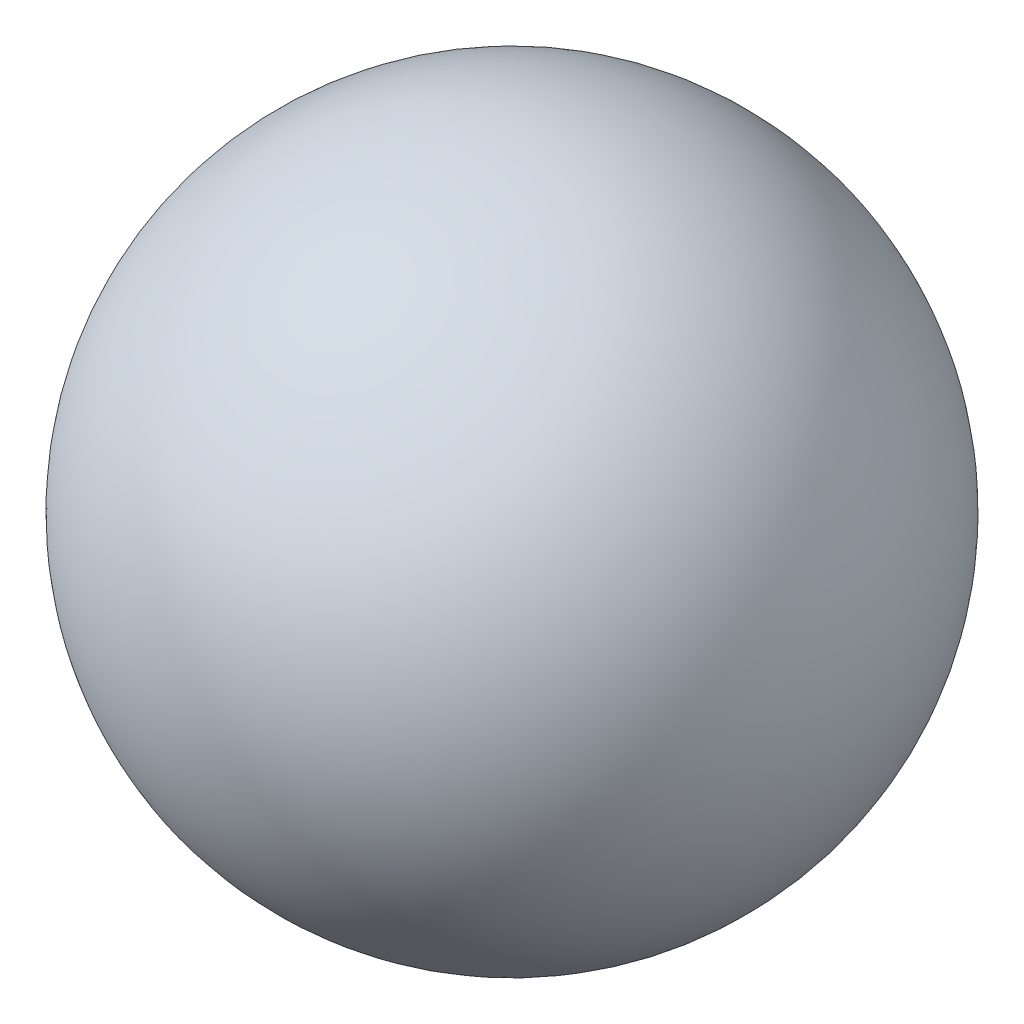
ISO-10303-21;
HEADER;
FILE_DESCRIPTION(('STEP AP214'),'2;1');
FILE_NAME('part.step','',(''),(''),'','','');
FILE_SCHEMA(('AUTOMOTIVE_DESIGN { 1 0 10303 214 1 1 1 1 }'));
ENDSEC;
DATA;
#1=APPLICATION_CONTEXT('core data for automotive mechanical design processes');
#2=APPLICATION_PROTOCOL_DEFINITION('international standard','automotive_design',2000,#1);
#3=PRODUCT_CONTEXT('',#1,'mechanical');
#4=PRODUCT('Part','Part','',(#3));
#5=PRODUCT_RELATED_PRODUCT_CATEGORY('part','',(#4));
#6=PRODUCT_DEFINITION_FORMATION('','',#4);
#7=PRODUCT_DEFINITION_CONTEXT('part definition',#1,'design');
#8=PRODUCT_DEFINITION('design','',#6,#7);
#9=PRODUCT_DEFINITION_SHAPE('','',#8);
#10=(LENGTH_UNIT() NAMED_UNIT(*) SI_UNIT(.MILLI.,.METRE.));
#11=(NAMED_UNIT(*) PLANE_ANGLE_UNIT() SI_UNIT($,.RADIAN.));
#12=(NAMED_UNIT(*) SI_UNIT($,.STERADIAN.) SOLID_ANGLE_UNIT());
#13=UNCERTAINTY_MEASURE_WITH_UNIT(LENGTH_MEASURE(1.E-05),#10,'distance_accuracy_value','');
#14=(GEOMETRIC_REPRESENTATION_CONTEXT(3) GLOBAL_UNCERTAINTY_ASSIGNED_CONTEXT((#13)) GLOBAL_UNIT_ASSIGNED_CONTEXT((#10,
#11,#12)) REPRESENTATION_CONTEXT('',''));
#15=CARTESIAN_POINT('',(0.,0.,0.));
#16=DIRECTION('',(0.,0.,1.));
#17=DIRECTION('',(1.,0.,0.));
#18=AXIS2_PLACEMENT_3D('',#15,#16,#17);
#19=CARTESIAN_POINT('',(0.,0.,88.9));
#20=DIRECTION('',(0.,0.,-1.));
#21=DIRECTION('',(-1.,0.,0.));
#22=AXIS2_PLACEMENT_3D('',#19,#20,#21);
#23=SPHERICAL_SURFACE('',#22,88.9);
#24=CARTESIAN_POINT('',(0.,0.,0.));
#25=VERTEX_POINT('',#24);
#26=VERTEX_LOOP('',#25);
#27=FACE_BOUND('',#26,.T.);
#28=ADVANCED_FACE('F35',(#27),#23,.T.);
#29=CLOSED_SHELL('',(#28));
#30=MANIFOLD_SOLID_BREP('B2',#29);
#31=ADVANCED_BREP_SHAPE_REPRESENTATION('',(#18,#30),#14);
#32=SHAPE_DEFINITION_REPRESENTATION(#9,#31);
ENDSEC;
END-ISO-10303-21;
